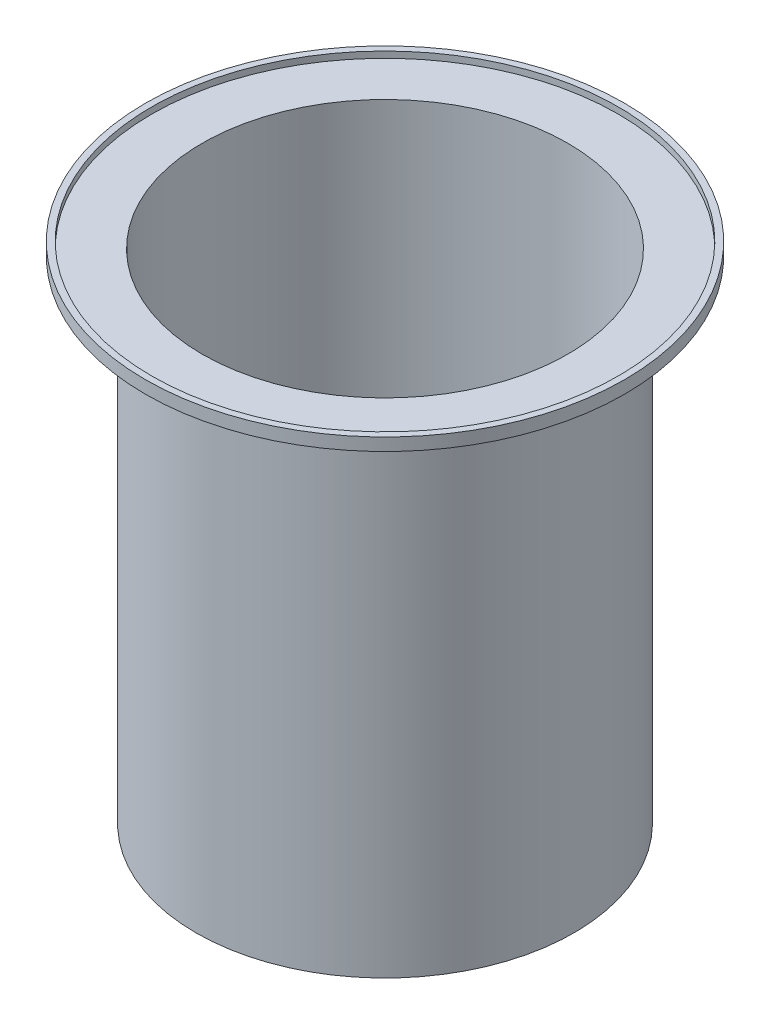
ISO-10303-21;
HEADER;
FILE_DESCRIPTION(('STEP AP214'),'2;1');
FILE_NAME('part.step','',(''),(''),'','','');
FILE_SCHEMA(('AUTOMOTIVE_DESIGN { 1 0 10303 214 1 1 1 1 }'));
ENDSEC;
DATA;
#1=APPLICATION_CONTEXT('core data for automotive mechanical design processes');
#2=APPLICATION_PROTOCOL_DEFINITION('international standard','automotive_design',2000,#1);
#3=PRODUCT_CONTEXT('',#1,'mechanical');
#4=PRODUCT('Part','Part','',(#3));
#5=PRODUCT_RELATED_PRODUCT_CATEGORY('part','',(#4));
#6=PRODUCT_DEFINITION_FORMATION('','',#4);
#7=PRODUCT_DEFINITION_CONTEXT('part definition',#1,'design');
#8=PRODUCT_DEFINITION('design','',#6,#7);
#9=PRODUCT_DEFINITION_SHAPE('','',#8);
#10=(LENGTH_UNIT() NAMED_UNIT(*) SI_UNIT(.MILLI.,.METRE.));
#11=(NAMED_UNIT(*) PLANE_ANGLE_UNIT() SI_UNIT($,.RADIAN.));
#12=(NAMED_UNIT(*) SI_UNIT($,.STERADIAN.) SOLID_ANGLE_UNIT());
#13=UNCERTAINTY_MEASURE_WITH_UNIT(LENGTH_MEASURE(1.E-05),#10,'distance_accuracy_value','');
#14=(GEOMETRIC_REPRESENTATION_CONTEXT(3) GLOBAL_UNCERTAINTY_ASSIGNED_CONTEXT((#13)) GLOBAL_UNIT_ASSIGNED_CONTEXT((#10,
#11,#12)) REPRESENTATION_CONTEXT('',''));
#15=CARTESIAN_POINT('',(0.,0.,0.));
#16=DIRECTION('',(0.,0.,1.));
#17=DIRECTION('',(1.,0.,0.));
#18=AXIS2_PLACEMENT_3D('',#15,#16,#17);
#19=CARTESIAN_POINT('',(0.,329.971145897652,190.));
#20=DIRECTION('',(0.,1.,0.));
#21=DIRECTION('',(0.,0.,1.));
#22=AXIS2_PLACEMENT_3D('',#19,#20,#21);
#23=PLANE('',#22);
#24=CARTESIAN_POINT('',(0.,329.971145897652,0.));
#25=DIRECTION('',(0.,1.,0.));
#26=DIRECTION('',(0.,0.,1.));
#27=AXIS2_PLACEMENT_3D('',#24,#25,#26);
#28=CIRCLE('',#27,185.);
#29=CARTESIAN_POINT('',(0.,329.971145897652,185.));
#30=VERTEX_POINT('',#29);
#31=EDGE_CURVE('E51',#30,#30,#28,.T.);
#32=ORIENTED_EDGE('',*,*,#31,.F.);
#33=EDGE_LOOP('',(#32));
#34=FACE_BOUND('',#33,.T.);
#35=CARTESIAN_POINT('',(0.,329.971145897652,0.));
#36=DIRECTION('',(0.,1.,0.));
#37=DIRECTION('',(0.,0.,1.));
#38=AXIS2_PLACEMENT_3D('',#35,#36,#37);
#39=CIRCLE('',#38,190.);
#40=CARTESIAN_POINT('',(0.,329.971145897652,190.));
#41=VERTEX_POINT('',#40);
#42=EDGE_CURVE('E45',#41,#41,#39,.T.);
#43=ORIENTED_EDGE('',*,*,#42,.T.);
#44=EDGE_LOOP('',(#43));
#45=FACE_BOUND('',#44,.T.);
#46=ADVANCED_FACE('F31',(#34,#45),#23,.T.);
#47=CARTESIAN_POINT('',(0.,-70.0288541023477,0.));
#48=DIRECTION('',(0.,-1.,0.));
#49=DIRECTION('',(0.,0.,-1.));
#50=AXIS2_PLACEMENT_3D('',#47,#48,#49);
#51=PLANE('',#50);
#52=CARTESIAN_POINT('',(0.,-70.0288541023477,0.));
#53=DIRECTION('',(0.,1.,0.));
#54=DIRECTION('',(0.,0.,1.));
#55=AXIS2_PLACEMENT_3D('',#52,#53,#54);
#56=CIRCLE('',#55,150.);
#57=CARTESIAN_POINT('',(0.,-70.0288541023477,150.));
#58=VERTEX_POINT('',#57);
#59=EDGE_CURVE('E10',#58,#58,#56,.T.);
#60=ORIENTED_EDGE('',*,*,#59,.F.);
#61=EDGE_LOOP('',(#60));
#62=FACE_BOUND('',#61,.T.);
#63=ADVANCED_FACE('F85',(#62),#51,.T.);
#64=CARTESIAN_POINT('',(0.,438.369922809417,0.));
#65=DIRECTION('',(0.,1.,0.));
#66=DIRECTION('',(0.,0.,1.));
#67=AXIS2_PLACEMENT_3D('',#64,#65,#66);
#68=CYLINDRICAL_SURFACE('',#67,150.);
#69=ORIENTED_EDGE('',*,*,#59,.T.);
#70=EDGE_LOOP('',(#69));
#71=FACE_BOUND('',#70,.T.);
#72=CARTESIAN_POINT('',(0.,319.971145897652,0.));
#73=DIRECTION('',(0.,1.,0.));
#74=DIRECTION('',(0.,0.,1.));
#75=AXIS2_PLACEMENT_3D('',#72,#73,#74);
#76=CIRCLE('',#75,150.);
#77=CARTESIAN_POINT('',(0.,319.971145897652,150.));
#78=VERTEX_POINT('',#77);
#79=EDGE_CURVE('E37',#78,#78,#76,.T.);
#80=ORIENTED_EDGE('',*,*,#79,.F.);
#81=EDGE_LOOP('',(#80));
#82=FACE_BOUND('',#81,.T.);
#83=ADVANCED_FACE('F98',(#71,#82),#68,.T.);
#84=CARTESIAN_POINT('',(0.,319.971145897652,150.));
#85=DIRECTION('',(0.,-1.,0.));
#86=DIRECTION('',(0.,0.,-1.));
#87=AXIS2_PLACEMENT_3D('',#84,#85,#86);
#88=PLANE('',#87);
#89=ORIENTED_EDGE('',*,*,#79,.T.);
#90=EDGE_LOOP('',(#89));
#91=FACE_BOUND('',#90,.T.);
#92=CARTESIAN_POINT('',(0.,319.971145897652,0.));
#93=DIRECTION('',(0.,1.,0.));
#94=DIRECTION('',(0.,0.,1.));
#95=AXIS2_PLACEMENT_3D('',#92,#93,#94);
#96=CIRCLE('',#95,190.);
#97=CARTESIAN_POINT('',(0.,319.971145897652,190.));
#98=VERTEX_POINT('',#97);
#99=EDGE_CURVE('E41',#98,#98,#96,.T.);
#100=ORIENTED_EDGE('',*,*,#99,.F.);
#101=EDGE_LOOP('',(#100));
#102=FACE_BOUND('',#101,.T.);
#103=ADVANCED_FACE('F90',(#91,#102),#88,.T.);
#104=CARTESIAN_POINT('',(0.,438.369922809417,0.));
#105=DIRECTION('',(0.,1.,0.));
#106=DIRECTION('',(0.,0.,1.));
#107=AXIS2_PLACEMENT_3D('',#104,#105,#106);
#108=CYLINDRICAL_SURFACE('',#107,190.);
#109=ORIENTED_EDGE('',*,*,#99,.T.);
#110=EDGE_LOOP('',(#109));
#111=FACE_BOUND('',#110,.T.);
#112=ORIENTED_EDGE('',*,*,#42,.F.);
#113=EDGE_LOOP('',(#112));
#114=FACE_BOUND('',#113,.T.);
#115=ADVANCED_FACE('F88',(#111,#114),#108,.T.);
#116=CARTESIAN_POINT('',(0.,-65.0288541023477,0.));
#117=DIRECTION('',(0.,-1.,0.));
#118=DIRECTION('',(0.,0.,-1.));
#119=AXIS2_PLACEMENT_3D('',#116,#117,#118);
#120=PLANE('',#119);
#121=CARTESIAN_POINT('',(0.,-65.0288541023477,0.));
#122=DIRECTION('',(0.,-1.,0.));
#123=DIRECTION('',(0.,0.,-1.));
#124=AXIS2_PLACEMENT_3D('',#121,#122,#123);
#125=CIRCLE('',#124,145.);
#126=CARTESIAN_POINT('',(0.,-65.0288541023477,-145.));
#127=VERTEX_POINT('',#126);
#128=EDGE_CURVE('E50',#127,#127,#125,.F.);
#129=ORIENTED_EDGE('',*,*,#128,.T.);
#130=EDGE_LOOP('',(#129));
#131=FACE_BOUND('',#130,.T.);
#132=ADVANCED_FACE('F63',(#131),#120,.F.);
#133=CARTESIAN_POINT('',(0.,438.369922809417,0.));
#134=DIRECTION('',(0.,1.,0.));
#135=DIRECTION('',(0.,0.,1.));
#136=AXIS2_PLACEMENT_3D('',#133,#134,#135);
#137=CYLINDRICAL_SURFACE('',#136,145.);
#138=ORIENTED_EDGE('',*,*,#128,.F.);
#139=EDGE_LOOP('',(#138));
#140=FACE_BOUND('',#139,.T.);
#141=CARTESIAN_POINT('',(0.,324.971145897652,0.));
#142=DIRECTION('',(0.,-1.,0.));
#143=DIRECTION('',(0.,0.,-1.));
#144=AXIS2_PLACEMENT_3D('',#141,#142,#143);
#145=CIRCLE('',#144,145.);
#146=CARTESIAN_POINT('',(0.,324.971145897652,-145.));
#147=VERTEX_POINT('',#146);
#148=EDGE_CURVE('E57',#147,#147,#145,.F.);
#149=ORIENTED_EDGE('',*,*,#148,.T.);
#150=EDGE_LOOP('',(#149));
#151=FACE_BOUND('',#150,.T.);
#152=ADVANCED_FACE('F65',(#140,#151),#137,.F.);
#153=CARTESIAN_POINT('',(0.,324.971145897652,150.));
#154=DIRECTION('',(0.,-1.,0.));
#155=DIRECTION('',(0.,0.,-1.));
#156=AXIS2_PLACEMENT_3D('',#153,#154,#155);
#157=PLANE('',#156);
#158=ORIENTED_EDGE('',*,*,#148,.F.);
#159=EDGE_LOOP('',(#158));
#160=FACE_BOUND('',#159,.T.);
#161=CARTESIAN_POINT('',(0.,324.971145897652,0.));
#162=DIRECTION('',(0.,-1.,0.));
#163=DIRECTION('',(0.,0.,-1.));
#164=AXIS2_PLACEMENT_3D('',#161,#162,#163);
#165=CIRCLE('',#164,185.);
#166=CARTESIAN_POINT('',(0.,324.971145897652,-185.));
#167=VERTEX_POINT('',#166);
#168=EDGE_CURVE('E54',#167,#167,#165,.F.);
#169=ORIENTED_EDGE('',*,*,#168,.T.);
#170=EDGE_LOOP('',(#169));
#171=FACE_BOUND('',#170,.T.);
#172=ADVANCED_FACE('F68',(#160,#171),#157,.F.);
#173=CARTESIAN_POINT('',(0.,438.369922809417,0.));
#174=DIRECTION('',(0.,1.,0.));
#175=DIRECTION('',(0.,0.,1.));
#176=AXIS2_PLACEMENT_3D('',#173,#174,#175);
#177=CYLINDRICAL_SURFACE('',#176,185.);
#178=ORIENTED_EDGE('',*,*,#168,.F.);
#179=EDGE_LOOP('',(#178));
#180=FACE_BOUND('',#179,.T.);
#181=ORIENTED_EDGE('',*,*,#31,.T.);
#182=EDGE_LOOP('',(#181));
#183=FACE_BOUND('',#182,.T.);
#184=ADVANCED_FACE('F74',(#180,#183),#177,.F.);
#185=CLOSED_SHELL('',(#46,#63,#83,#103,#115,#132,#152,#172,#184));
#186=MANIFOLD_SOLID_BREP('B2',#185);
#187=ADVANCED_BREP_SHAPE_REPRESENTATION('',(#18,#186),#14);
#188=SHAPE_DEFINITION_REPRESENTATION(#9,#187);
ENDSEC;
END-ISO-10303-21;
